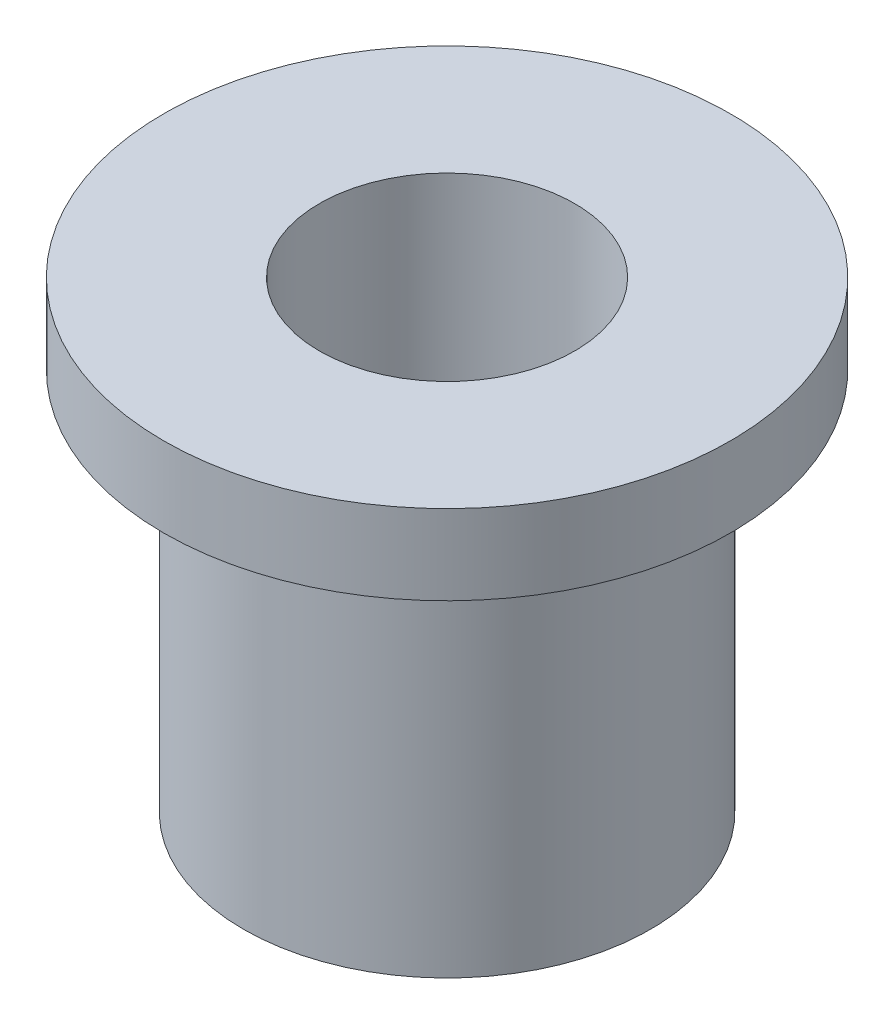
ISO-10303-21;
HEADER;
FILE_DESCRIPTION(('STEP AP214'),'2;1');
FILE_NAME('part.step','',(''),(''),'','','');
FILE_SCHEMA(('AUTOMOTIVE_DESIGN { 1 0 10303 214 1 1 1 1 }'));
ENDSEC;
DATA;
#1=APPLICATION_CONTEXT('core data for automotive mechanical design processes');
#2=APPLICATION_PROTOCOL_DEFINITION('international standard','automotive_design',2000,#1);
#3=PRODUCT_CONTEXT('',#1,'mechanical');
#4=PRODUCT('Part','Part','',(#3));
#5=PRODUCT_RELATED_PRODUCT_CATEGORY('part','',(#4));
#6=PRODUCT_DEFINITION_FORMATION('','',#4);
#7=PRODUCT_DEFINITION_CONTEXT('part definition',#1,'design');
#8=PRODUCT_DEFINITION('design','',#6,#7);
#9=PRODUCT_DEFINITION_SHAPE('','',#8);
#10=(LENGTH_UNIT() NAMED_UNIT(*) SI_UNIT(.MILLI.,.METRE.));
#11=(NAMED_UNIT(*) PLANE_ANGLE_UNIT() SI_UNIT($,.RADIAN.));
#12=(NAMED_UNIT(*) SI_UNIT($,.STERADIAN.) SOLID_ANGLE_UNIT());
#13=UNCERTAINTY_MEASURE_WITH_UNIT(LENGTH_MEASURE(1.E-05),#10,'distance_accuracy_value','');
#14=(GEOMETRIC_REPRESENTATION_CONTEXT(3) GLOBAL_UNCERTAINTY_ASSIGNED_CONTEXT((#13)) GLOBAL_UNIT_ASSIGNED_CONTEXT((#10,
#11,#12)) REPRESENTATION_CONTEXT('',''));
#15=CARTESIAN_POINT('',(0.,0.,0.));
#16=DIRECTION('',(0.,0.,1.));
#17=DIRECTION('',(1.,0.,0.));
#18=AXIS2_PLACEMENT_3D('',#15,#16,#17);
#19=CARTESIAN_POINT('',(0.,5.8,0.));
#20=DIRECTION('',(0.,-1.,0.));
#21=DIRECTION('',(0.,0.,-1.));
#22=AXIS2_PLACEMENT_3D('',#19,#20,#21);
#23=CYLINDRICAL_SURFACE('',#22,2.55);
#24=CARTESIAN_POINT('',(0.,0.,0.));
#25=DIRECTION('',(0.,1.,0.));
#26=DIRECTION('',(0.,0.,1.));
#27=AXIS2_PLACEMENT_3D('',#24,#25,#26);
#28=CIRCLE('',#27,2.55);
#29=CARTESIAN_POINT('',(0.,0.,2.55));
#30=VERTEX_POINT('',#29);
#31=EDGE_CURVE('E42',#30,#30,#28,.T.);
#32=ORIENTED_EDGE('',*,*,#31,.T.);
#33=EDGE_LOOP('',(#32));
#34=FACE_BOUND('',#33,.T.);
#35=CARTESIAN_POINT('',(0.,4.8,0.));
#36=DIRECTION('',(0.,1.,0.));
#37=DIRECTION('',(0.,0.,1.));
#38=AXIS2_PLACEMENT_3D('',#35,#36,#37);
#39=CIRCLE('',#38,2.55);
#40=CARTESIAN_POINT('',(0.,4.8,2.55));
#41=VERTEX_POINT('',#40);
#42=EDGE_CURVE('E10',#41,#41,#39,.T.);
#43=ORIENTED_EDGE('',*,*,#42,.F.);
#44=EDGE_LOOP('',(#43));
#45=FACE_BOUND('',#44,.T.);
#46=ADVANCED_FACE('F39',(#34,#45),#23,.T.);
#47=CARTESIAN_POINT('',(0.,5.8,0.));
#48=DIRECTION('',(0.,1.,0.));
#49=DIRECTION('',(0.,0.,1.));
#50=AXIS2_PLACEMENT_3D('',#47,#48,#49);
#51=PLANE('',#50);
#52=CARTESIAN_POINT('',(0.,5.8,0.));
#53=DIRECTION('',(0.,1.,0.));
#54=DIRECTION('',(0.,0.,1.));
#55=AXIS2_PLACEMENT_3D('',#52,#53,#54);
#56=CIRCLE('',#55,1.6);
#57=CARTESIAN_POINT('',(0.,5.8,1.6));
#58=VERTEX_POINT('',#57);
#59=EDGE_CURVE('E50',#58,#58,#56,.T.);
#60=ORIENTED_EDGE('',*,*,#59,.F.);
#61=EDGE_LOOP('',(#60));
#62=FACE_BOUND('',#61,.T.);
#63=CARTESIAN_POINT('',(0.,5.8,0.));
#64=DIRECTION('',(0.,1.,0.));
#65=DIRECTION('',(0.,0.,1.));
#66=AXIS2_PLACEMENT_3D('',#63,#64,#65);
#67=CIRCLE('',#66,3.55);
#68=CARTESIAN_POINT('',(0.,5.8,3.55));
#69=VERTEX_POINT('',#68);
#70=EDGE_CURVE('E53',#69,#69,#67,.T.);
#71=ORIENTED_EDGE('',*,*,#70,.T.);
#72=EDGE_LOOP('',(#71));
#73=FACE_BOUND('',#72,.T.);
#74=ADVANCED_FACE('F67',(#62,#73),#51,.T.);
#75=CARTESIAN_POINT('',(0.,0.,0.));
#76=DIRECTION('',(0.,1.,0.));
#77=DIRECTION('',(0.,0.,1.));
#78=AXIS2_PLACEMENT_3D('',#75,#76,#77);
#79=PLANE('',#78);
#80=ORIENTED_EDGE('',*,*,#31,.F.);
#81=EDGE_LOOP('',(#80));
#82=FACE_BOUND('',#81,.T.);
#83=CARTESIAN_POINT('',(0.,0.,0.));
#84=DIRECTION('',(0.,1.,0.));
#85=DIRECTION('',(0.,0.,1.));
#86=AXIS2_PLACEMENT_3D('',#83,#84,#85);
#87=CIRCLE('',#86,1.6);
#88=CARTESIAN_POINT('',(0.,0.,1.6));
#89=VERTEX_POINT('',#88);
#90=EDGE_CURVE('E56',#89,#89,#87,.T.);
#91=ORIENTED_EDGE('',*,*,#90,.T.);
#92=EDGE_LOOP('',(#91));
#93=FACE_BOUND('',#92,.T.);
#94=ADVANCED_FACE('F86',(#82,#93),#79,.F.);
#95=CARTESIAN_POINT('',(0.,5.8,0.));
#96=DIRECTION('',(0.,-1.,0.));
#97=DIRECTION('',(0.,0.,-1.));
#98=AXIS2_PLACEMENT_3D('',#95,#96,#97);
#99=CYLINDRICAL_SURFACE('',#98,1.6);
#100=ORIENTED_EDGE('',*,*,#59,.T.);
#101=EDGE_LOOP('',(#100));
#102=FACE_BOUND('',#101,.T.);
#103=ORIENTED_EDGE('',*,*,#90,.F.);
#104=EDGE_LOOP('',(#103));
#105=FACE_BOUND('',#104,.T.);
#106=ADVANCED_FACE('F76',(#102,#105),#99,.F.);
#107=CARTESIAN_POINT('',(0.,4.8,0.));
#108=DIRECTION('',(0.,1.,0.));
#109=DIRECTION('',(0.,0.,1.));
#110=AXIS2_PLACEMENT_3D('',#107,#108,#109);
#111=PLANE('',#110);
#112=CARTESIAN_POINT('',(0.,4.8,0.));
#113=DIRECTION('',(0.,1.,0.));
#114=DIRECTION('',(0.,0.,1.));
#115=AXIS2_PLACEMENT_3D('',#112,#113,#114);
#116=CIRCLE('',#115,3.55);
#117=CARTESIAN_POINT('',(0.,4.8,3.55));
#118=VERTEX_POINT('',#117);
#119=EDGE_CURVE('E58',#118,#118,#116,.T.);
#120=ORIENTED_EDGE('',*,*,#119,.F.);
#121=EDGE_LOOP('',(#120));
#122=FACE_BOUND('',#121,.T.);
#123=ORIENTED_EDGE('',*,*,#42,.T.);
#124=EDGE_LOOP('',(#123));
#125=FACE_BOUND('',#124,.T.);
#126=ADVANCED_FACE('F71',(#122,#125),#111,.F.);
#127=CARTESIAN_POINT('',(0.,4.8,0.));
#128=DIRECTION('',(0.,1.,0.));
#129=DIRECTION('',(0.,0.,1.));
#130=AXIS2_PLACEMENT_3D('',#127,#128,#129);
#131=CYLINDRICAL_SURFACE('',#130,3.55);
#132=ORIENTED_EDGE('',*,*,#119,.T.);
#133=EDGE_LOOP('',(#132));
#134=FACE_BOUND('',#133,.T.);
#135=ORIENTED_EDGE('',*,*,#70,.F.);
#136=EDGE_LOOP('',(#135));
#137=FACE_BOUND('',#136,.T.);
#138=ADVANCED_FACE('F69',(#134,#137),#131,.T.);
#139=CLOSED_SHELL('',(#46,#74,#94,#106,#126,#138));
#140=MANIFOLD_SOLID_BREP('B2',#139);
#141=ADVANCED_BREP_SHAPE_REPRESENTATION('',(#18,#140),#14);
#142=SHAPE_DEFINITION_REPRESENTATION(#9,#141);
ENDSEC;
END-ISO-10303-21;
